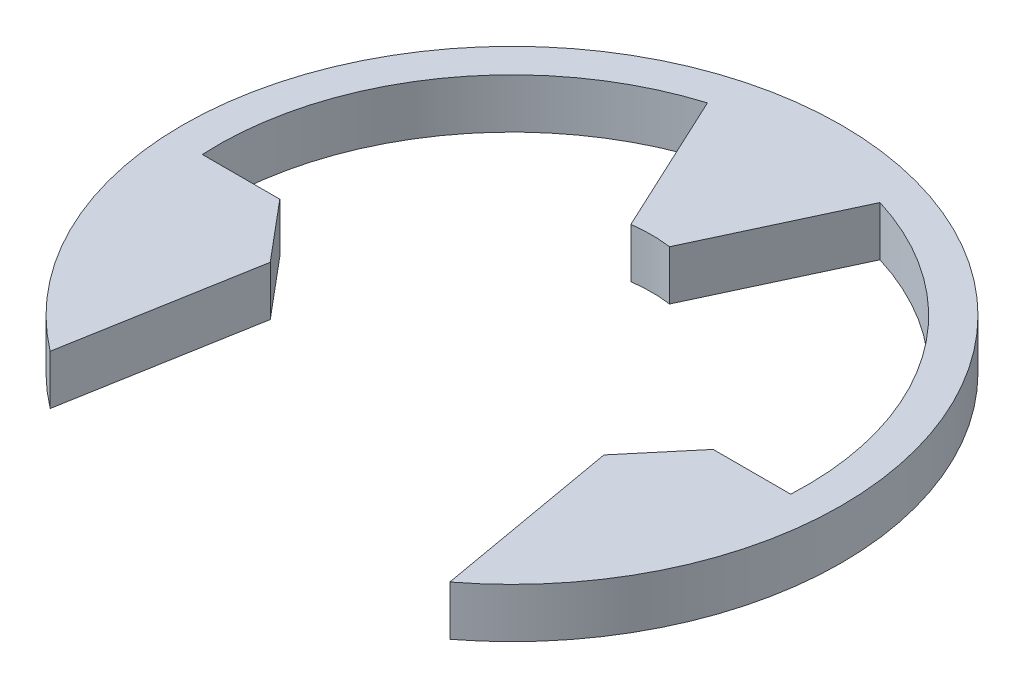
ISO-10303-21;
HEADER;
FILE_DESCRIPTION(('STEP AP214'),'2;1');
FILE_NAME('part.step','',(''),(''),'','','');
FILE_SCHEMA(('AUTOMOTIVE_DESIGN { 1 0 10303 214 1 1 1 1 }'));
ENDSEC;
DATA;
#1=APPLICATION_CONTEXT('core data for automotive mechanical design processes');
#2=APPLICATION_PROTOCOL_DEFINITION('international standard','automotive_design',2000,#1);
#3=PRODUCT_CONTEXT('',#1,'mechanical');
#4=PRODUCT('Part','Part','',(#3));
#5=PRODUCT_RELATED_PRODUCT_CATEGORY('part','',(#4));
#6=PRODUCT_DEFINITION_FORMATION('','',#4);
#7=PRODUCT_DEFINITION_CONTEXT('part definition',#1,'design');
#8=PRODUCT_DEFINITION('design','',#6,#7);
#9=PRODUCT_DEFINITION_SHAPE('','',#8);
#10=(LENGTH_UNIT() NAMED_UNIT(*) SI_UNIT(.MILLI.,.METRE.));
#11=(NAMED_UNIT(*) PLANE_ANGLE_UNIT() SI_UNIT($,.RADIAN.));
#12=(NAMED_UNIT(*) SI_UNIT($,.STERADIAN.) SOLID_ANGLE_UNIT());
#13=UNCERTAINTY_MEASURE_WITH_UNIT(LENGTH_MEASURE(1.E-05),#10,'distance_accuracy_value','');
#14=(GEOMETRIC_REPRESENTATION_CONTEXT(3) GLOBAL_UNCERTAINTY_ASSIGNED_CONTEXT((#13)) GLOBAL_UNIT_ASSIGNED_CONTEXT((#10,
#11,#12)) REPRESENTATION_CONTEXT('',''));
#15=CARTESIAN_POINT('',(0.,0.,0.));
#16=DIRECTION('',(0.,0.,1.));
#17=DIRECTION('',(1.,0.,0.));
#18=AXIS2_PLACEMENT_3D('',#15,#16,#17);
#19=CARTESIAN_POINT('',(0.,0.64,0.));
#20=DIRECTION('',(0.,-1.,0.));
#21=DIRECTION('',(0.,0.,-1.));
#22=AXIS2_PLACEMENT_3D('',#19,#20,#21);
#23=CYLINDRICAL_SURFACE('',#22,1.8);
#24=CARTESIAN_POINT('',(0.,0.,0.));
#25=DIRECTION('',(0.,1.,0.));
#26=DIRECTION('',(0.,0.,1.));
#27=AXIS2_PLACEMENT_3D('',#24,#25,#26);
#28=CIRCLE('',#27,1.8);
#29=CARTESIAN_POINT('',(0.24951124097924,0.,-1.78262282623807));
#30=VERTEX_POINT('',#29);
#31=CARTESIAN_POINT('',(-0.249511240979239,0.,-1.78262282623807));
#32=VERTEX_POINT('',#31);
#33=EDGE_CURVE('E150',#30,#32,#28,.T.);
#34=ORIENTED_EDGE('',*,*,#33,.F.);
#35=DIRECTION('',(0.,-1.,0.));
#36=VECTOR('',#35,1.);
#37=CARTESIAN_POINT('',(0.24951124097924,0.64,-1.78262282623807));
#38=LINE('',#37,#36);
#39=CARTESIAN_POINT('',(0.24951124097924,0.64,-1.78262282623807));
#40=VERTEX_POINT('',#39);
#41=EDGE_CURVE('E11',#40,#30,#38,.T.);
#42=ORIENTED_EDGE('',*,*,#41,.F.);
#43=CARTESIAN_POINT('',(0.,0.64,0.));
#44=DIRECTION('',(0.,1.,0.));
#45=DIRECTION('',(0.,0.,1.));
#46=AXIS2_PLACEMENT_3D('',#43,#44,#45);
#47=CIRCLE('',#46,1.8);
#48=CARTESIAN_POINT('',(-0.249511240979239,0.64,-1.78262282623807));
#49=VERTEX_POINT('',#48);
#50=EDGE_CURVE('E182',#40,#49,#47,.T.);
#51=ORIENTED_EDGE('',*,*,#50,.T.);
#52=DIRECTION('',(0.,-1.,0.));
#53=VECTOR('',#52,1.);
#54=CARTESIAN_POINT('',(-0.249511240979239,0.64,-1.78262282623807));
#55=LINE('',#54,#53);
#56=EDGE_CURVE('E48',#49,#32,#55,.T.);
#57=ORIENTED_EDGE('',*,*,#56,.T.);
#58=EDGE_LOOP('',(#34,#42,#51,#57));
#59=FACE_BOUND('',#58,.T.);
#60=ADVANCED_FACE('F32',(#59),#23,.F.);
#61=CARTESIAN_POINT('',(-0.477837167529248,0.64,-0.222819130569977));
#62=DIRECTION('',(-0.906307787036653,0.,-0.422618261740693));
#63=DIRECTION('',(-0.422618261740694,0.,0.906307787036653));
#64=AXIS2_PLACEMENT_3D('',#61,#62,#63);
#65=PLANE('',#64);
#66=DIRECTION('',(0.422618261740693,0.,-0.906307787036653));
#67=VECTOR('',#66,1.);
#68=CARTESIAN_POINT('',(-0.477837167529248,0.,-0.222819130569977));
#69=LINE('',#68,#67);
#70=CARTESIAN_POINT('',(1.11257947383086,0.,-3.63347862446035));
#71=VERTEX_POINT('',#70);
#72=EDGE_CURVE('E152',#30,#71,#69,.T.);
#73=ORIENTED_EDGE('',*,*,#72,.T.);
#74=DIRECTION('',(0.,-1.,0.));
#75=VECTOR('',#74,1.);
#76=CARTESIAN_POINT('',(1.11257947383086,0.64,-3.63347862446035));
#77=LINE('',#76,#75);
#78=CARTESIAN_POINT('',(1.11257947383086,0.64,-3.63347862446035));
#79=VERTEX_POINT('',#78);
#80=EDGE_CURVE('E40',#79,#71,#77,.T.);
#81=ORIENTED_EDGE('',*,*,#80,.F.);
#82=DIRECTION('',(0.422618261740693,0.,-0.906307787036653));
#83=VECTOR('',#82,1.);
#84=CARTESIAN_POINT('',(-0.477837167529248,0.64,-0.222819130569977));
#85=LINE('',#84,#83);
#86=EDGE_CURVE('E218',#40,#79,#85,.T.);
#87=ORIENTED_EDGE('',*,*,#86,.F.);
#88=ORIENTED_EDGE('',*,*,#41,.T.);
#89=EDGE_LOOP('',(#73,#81,#87,#88));
#90=FACE_BOUND('',#89,.T.);
#91=ADVANCED_FACE('F206',(#90),#65,.F.);
#92=CARTESIAN_POINT('',(0.,0.64,0.));
#93=DIRECTION('',(0.,-1.,0.));
#94=DIRECTION('',(0.,0.,-1.));
#95=AXIS2_PLACEMENT_3D('',#92,#93,#94);
#96=CYLINDRICAL_SURFACE('',#95,3.8);
#97=CARTESIAN_POINT('',(0.,0.,0.));
#98=DIRECTION('',(0.,1.,0.));
#99=DIRECTION('',(0.,0.,1.));
#100=AXIS2_PLACEMENT_3D('',#97,#98,#99);
#101=CIRCLE('',#100,3.8);
#102=CARTESIAN_POINT('',(3.79473319220206,0.,0.199999999999999));
#103=VERTEX_POINT('',#102);
#104=EDGE_CURVE('E155',#103,#71,#101,.T.);
#105=ORIENTED_EDGE('',*,*,#104,.F.);
#106=DIRECTION('',(0.,-1.,0.));
#107=VECTOR('',#106,1.);
#108=CARTESIAN_POINT('',(3.79473319220206,0.64,0.199999999999999));
#109=LINE('',#108,#107);
#110=CARTESIAN_POINT('',(3.79473319220206,0.64,0.199999999999999));
#111=VERTEX_POINT('',#110);
#112=EDGE_CURVE('E196',#111,#103,#109,.T.);
#113=ORIENTED_EDGE('',*,*,#112,.F.);
#114=CARTESIAN_POINT('',(0.,0.64,0.));
#115=DIRECTION('',(0.,1.,0.));
#116=DIRECTION('',(0.,0.,1.));
#117=AXIS2_PLACEMENT_3D('',#114,#115,#116);
#118=CIRCLE('',#117,3.8);
#119=EDGE_CURVE('E203',#111,#79,#118,.T.);
#120=ORIENTED_EDGE('',*,*,#119,.T.);
#121=ORIENTED_EDGE('',*,*,#80,.T.);
#122=EDGE_LOOP('',(#105,#113,#120,#121));
#123=FACE_BOUND('',#122,.T.);
#124=ADVANCED_FACE('F201',(#123),#96,.F.);
#125=CARTESIAN_POINT('',(0.,0.64,0.2));
#126=DIRECTION('',(0.,0.,-1.));
#127=DIRECTION('',(-1.,0.,0.));
#128=AXIS2_PLACEMENT_3D('',#125,#126,#127);
#129=PLANE('',#128);
#130=DIRECTION('',(1.,0.,0.));
#131=VECTOR('',#130,1.);
#132=CARTESIAN_POINT('',(0.,0.,0.2));
#133=LINE('',#132,#131);
#134=CARTESIAN_POINT('',(2.79473319220206,0.,0.199999999999999));
#135=VERTEX_POINT('',#134);
#136=EDGE_CURVE('E158',#135,#103,#133,.T.);
#137=ORIENTED_EDGE('',*,*,#136,.F.);
#138=DIRECTION('',(0.,-1.,0.));
#139=VECTOR('',#138,1.);
#140=CARTESIAN_POINT('',(2.79473319220206,0.64,0.199999999999999));
#141=LINE('',#140,#139);
#142=CARTESIAN_POINT('',(2.79473319220206,0.64,0.199999999999999));
#143=VERTEX_POINT('',#142);
#144=EDGE_CURVE('E194',#143,#135,#141,.T.);
#145=ORIENTED_EDGE('',*,*,#144,.F.);
#146=DIRECTION('',(1.,0.,0.));
#147=VECTOR('',#146,1.);
#148=CARTESIAN_POINT('',(0.,0.64,0.2));
#149=LINE('',#148,#147);
#150=EDGE_CURVE('E215',#143,#111,#149,.T.);
#151=ORIENTED_EDGE('',*,*,#150,.T.);
#152=ORIENTED_EDGE('',*,*,#112,.T.);
#153=EDGE_LOOP('',(#137,#145,#151,#152));
#154=FACE_BOUND('',#153,.T.);
#155=ADVANCED_FACE('F212',(#154),#129,.T.);
#156=CARTESIAN_POINT('',(1.73849753434784,0.64,1.45877263987388));
#157=DIRECTION('',(-0.76604444311898,0.,-0.642787609686537));
#158=DIRECTION('',(-0.642787609686537,0.,0.76604444311898));
#159=AXIS2_PLACEMENT_3D('',#156,#157,#158);
#160=PLANE('',#159);
#161=DIRECTION('',(0.642787609686537,0.,-0.76604444311898));
#162=VECTOR('',#161,1.);
#163=CARTESIAN_POINT('',(1.73849753434784,0.,1.45877263987388));
#164=LINE('',#163,#162);
#165=CARTESIAN_POINT('',(2.15194558251552,0.,0.966044443118979));
#166=VERTEX_POINT('',#165);
#167=EDGE_CURVE('E161',#166,#135,#164,.T.);
#168=ORIENTED_EDGE('',*,*,#167,.F.);
#169=DIRECTION('',(0.,-1.,0.));
#170=VECTOR('',#169,1.);
#171=CARTESIAN_POINT('',(2.15194558251552,0.64,0.966044443118979));
#172=LINE('',#171,#170);
#173=CARTESIAN_POINT('',(2.15194558251552,0.64,0.966044443118979));
#174=VERTEX_POINT('',#173);
#175=EDGE_CURVE('E192',#174,#166,#172,.T.);
#176=ORIENTED_EDGE('',*,*,#175,.F.);
#177=DIRECTION('',(0.642787609686537,0.,-0.76604444311898));
#178=VECTOR('',#177,1.);
#179=CARTESIAN_POINT('',(1.73849753434784,0.64,1.45877263987388));
#180=LINE('',#179,#178);
#181=EDGE_CURVE('E220',#174,#143,#180,.T.);
#182=ORIENTED_EDGE('',*,*,#181,.T.);
#183=ORIENTED_EDGE('',*,*,#144,.T.);
#184=EDGE_LOOP('',(#168,#176,#182,#183));
#185=FACE_BOUND('',#184,.T.);
#186=ADVANCED_FACE('F258',(#185),#160,.T.);
#187=CARTESIAN_POINT('',(1.92185315392182,0.64,-0.338874563996086));
#188=DIRECTION('',(-0.984807753012207,0.,0.173648177666935));
#189=DIRECTION('',(0.173648177666935,0.,0.984807753012207));
#190=AXIS2_PLACEMENT_3D('',#187,#188,#189);
#191=PLANE('',#190);
#192=DIRECTION('',(-0.173648177666935,0.,-0.984807753012207));
#193=VECTOR('',#192,1.);
#194=CARTESIAN_POINT('',(1.92185315392182,0.,-0.338874563996086));
#195=LINE('',#194,#193);
#196=CARTESIAN_POINT('',(2.57745596691439,0.,3.37923375021874));
#197=VERTEX_POINT('',#196);
#198=EDGE_CURVE('E164',#197,#166,#195,.T.);
#199=ORIENTED_EDGE('',*,*,#198,.F.);
#200=DIRECTION('',(0.,-1.,0.));
#201=VECTOR('',#200,1.);
#202=CARTESIAN_POINT('',(2.57745596691439,0.64,3.37923375021874));
#203=LINE('',#202,#201);
#204=CARTESIAN_POINT('',(2.57745596691439,0.64,3.37923375021874));
#205=VERTEX_POINT('',#204);
#206=EDGE_CURVE('E190',#205,#197,#203,.T.);
#207=ORIENTED_EDGE('',*,*,#206,.F.);
#208=DIRECTION('',(-0.173648177666935,0.,-0.984807753012207));
#209=VECTOR('',#208,1.);
#210=CARTESIAN_POINT('',(1.92185315392182,0.64,-0.338874563996086));
#211=LINE('',#210,#209);
#212=EDGE_CURVE('E226',#205,#174,#211,.T.);
#213=ORIENTED_EDGE('',*,*,#212,.T.);
#214=ORIENTED_EDGE('',*,*,#175,.T.);
#215=EDGE_LOOP('',(#199,#207,#213,#214));
#216=FACE_BOUND('',#215,.T.);
#217=ADVANCED_FACE('F261',(#216),#191,.T.);
#218=CARTESIAN_POINT('',(0.,0.64,0.));
#219=DIRECTION('',(0.,-1.,0.));
#220=DIRECTION('',(0.,0.,-1.));
#221=AXIS2_PLACEMENT_3D('',#218,#219,#220);
#222=CYLINDRICAL_SURFACE('',#221,4.25);
#223=CARTESIAN_POINT('',(0.,0.,0.));
#224=DIRECTION('',(0.,1.,0.));
#225=DIRECTION('',(0.,0.,1.));
#226=AXIS2_PLACEMENT_3D('',#223,#224,#225);
#227=CIRCLE('',#226,4.25);
#228=CARTESIAN_POINT('',(-2.57745596691438,0.,3.37923375021875));
#229=VERTEX_POINT('',#228);
#230=EDGE_CURVE('E167',#197,#229,#227,.T.);
#231=ORIENTED_EDGE('',*,*,#230,.T.);
#232=DIRECTION('',(0.,-1.,0.));
#233=VECTOR('',#232,1.);
#234=CARTESIAN_POINT('',(-2.57745596691438,0.64,3.37923375021875));
#235=LINE('',#234,#233);
#236=CARTESIAN_POINT('',(-2.57745596691438,0.64,3.37923375021875));
#237=VERTEX_POINT('',#236);
#238=EDGE_CURVE('E188',#237,#229,#235,.T.);
#239=ORIENTED_EDGE('',*,*,#238,.F.);
#240=CARTESIAN_POINT('',(0.,0.64,0.));
#241=DIRECTION('',(0.,1.,0.));
#242=DIRECTION('',(0.,0.,1.));
#243=AXIS2_PLACEMENT_3D('',#240,#241,#242);
#244=CIRCLE('',#243,4.25);
#245=EDGE_CURVE('E229',#205,#237,#244,.T.);
#246=ORIENTED_EDGE('',*,*,#245,.F.);
#247=ORIENTED_EDGE('',*,*,#206,.T.);
#248=EDGE_LOOP('',(#231,#239,#246,#247));
#249=FACE_BOUND('',#248,.T.);
#250=ADVANCED_FACE('F265',(#249),#222,.T.);
#251=CARTESIAN_POINT('',(-1.92185315392168,0.64,-0.338874563996129));
#252=DIRECTION('',(0.984807753012201,0.,0.173648177666969));
#253=DIRECTION('',(0.173648177666969,0.,-0.984807753012201));
#254=AXIS2_PLACEMENT_3D('',#251,#252,#253);
#255=PLANE('',#254);
#256=DIRECTION('',(-0.173648177666969,0.,0.984807753012201));
#257=VECTOR('',#256,1.);
#258=CARTESIAN_POINT('',(-1.92185315392168,0.,-0.338874563996129));
#259=LINE('',#258,#257);
#260=CARTESIAN_POINT('',(-2.15194558251552,0.,0.96604444311898));
#261=VERTEX_POINT('',#260);
#262=EDGE_CURVE('E170',#261,#229,#259,.T.);
#263=ORIENTED_EDGE('',*,*,#262,.F.);
#264=DIRECTION('',(0.,-1.,0.));
#265=VECTOR('',#264,1.);
#266=CARTESIAN_POINT('',(-2.15194558251552,0.64,0.96604444311898));
#267=LINE('',#266,#265);
#268=CARTESIAN_POINT('',(-2.15194558251552,0.64,0.96604444311898));
#269=VERTEX_POINT('',#268);
#270=EDGE_CURVE('E186',#269,#261,#267,.T.);
#271=ORIENTED_EDGE('',*,*,#270,.F.);
#272=DIRECTION('',(-0.173648177666969,0.,0.984807753012201));
#273=VECTOR('',#272,1.);
#274=CARTESIAN_POINT('',(-1.92185315392168,0.64,-0.338874563996129));
#275=LINE('',#274,#273);
#276=EDGE_CURVE('E231',#269,#237,#275,.T.);
#277=ORIENTED_EDGE('',*,*,#276,.T.);
#278=ORIENTED_EDGE('',*,*,#238,.T.);
#279=EDGE_LOOP('',(#263,#271,#277,#278));
#280=FACE_BOUND('',#279,.T.);
#281=ADVANCED_FACE('F269',(#280),#255,.T.);
#282=CARTESIAN_POINT('',(-1.73849753434784,0.64,1.45877263987388));
#283=DIRECTION('',(0.766044443118979,0.,-0.642787609686537));
#284=DIRECTION('',(-0.642787609686538,0.,-0.76604444311898));
#285=AXIS2_PLACEMENT_3D('',#282,#283,#284);
#286=PLANE('',#285);
#287=DIRECTION('',(0.642787609686538,0.,0.76604444311898));
#288=VECTOR('',#287,1.);
#289=CARTESIAN_POINT('',(-1.73849753434784,0.,1.45877263987388));
#290=LINE('',#289,#288);
#291=CARTESIAN_POINT('',(-2.79473319220206,0.,0.2));
#292=VERTEX_POINT('',#291);
#293=EDGE_CURVE('E173',#292,#261,#290,.T.);
#294=ORIENTED_EDGE('',*,*,#293,.F.);
#295=DIRECTION('',(0.,-1.,0.));
#296=VECTOR('',#295,1.);
#297=CARTESIAN_POINT('',(-2.79473319220206,0.64,0.2));
#298=LINE('',#297,#296);
#299=CARTESIAN_POINT('',(-2.79473319220206,0.64,0.2));
#300=VERTEX_POINT('',#299);
#301=EDGE_CURVE('E131',#300,#292,#298,.T.);
#302=ORIENTED_EDGE('',*,*,#301,.F.);
#303=DIRECTION('',(0.642787609686538,0.,0.76604444311898));
#304=VECTOR('',#303,1.);
#305=CARTESIAN_POINT('',(-1.73849753434784,0.64,1.45877263987388));
#306=LINE('',#305,#304);
#307=EDGE_CURVE('E142',#300,#269,#306,.T.);
#308=ORIENTED_EDGE('',*,*,#307,.T.);
#309=ORIENTED_EDGE('',*,*,#270,.T.);
#310=EDGE_LOOP('',(#294,#302,#308,#309));
#311=FACE_BOUND('',#310,.T.);
#312=ADVANCED_FACE('F235',(#311),#286,.T.);
#313=CARTESIAN_POINT('',(0.,0.64,0.2));
#314=DIRECTION('',(0.,0.,-1.));
#315=DIRECTION('',(-1.,0.,0.));
#316=AXIS2_PLACEMENT_3D('',#313,#314,#315);
#317=PLANE('',#316);
#318=DIRECTION('',(1.,0.,0.));
#319=VECTOR('',#318,1.);
#320=CARTESIAN_POINT('',(0.,0.,0.2));
#321=LINE('',#320,#319);
#322=CARTESIAN_POINT('',(-3.79473319220206,0.,0.2));
#323=VERTEX_POINT('',#322);
#324=EDGE_CURVE('E127',#323,#292,#321,.T.);
#325=ORIENTED_EDGE('',*,*,#324,.F.);
#326=DIRECTION('',(0.,-1.,0.));
#327=VECTOR('',#326,1.);
#328=CARTESIAN_POINT('',(-3.79473319220206,0.64,0.2));
#329=LINE('',#328,#327);
#330=CARTESIAN_POINT('',(-3.79473319220206,0.64,0.2));
#331=VERTEX_POINT('',#330);
#332=EDGE_CURVE('E122',#331,#323,#329,.T.);
#333=ORIENTED_EDGE('',*,*,#332,.F.);
#334=DIRECTION('',(1.,0.,0.));
#335=VECTOR('',#334,1.);
#336=CARTESIAN_POINT('',(0.,0.64,0.2));
#337=LINE('',#336,#335);
#338=EDGE_CURVE('E125',#331,#300,#337,.T.);
#339=ORIENTED_EDGE('',*,*,#338,.T.);
#340=ORIENTED_EDGE('',*,*,#301,.T.);
#341=EDGE_LOOP('',(#325,#333,#339,#340));
#342=FACE_BOUND('',#341,.T.);
#343=ADVANCED_FACE('F124',(#342),#317,.T.);
#344=CARTESIAN_POINT('',(0.,0.64,0.));
#345=DIRECTION('',(0.,-1.,0.));
#346=DIRECTION('',(0.,0.,-1.));
#347=AXIS2_PLACEMENT_3D('',#344,#345,#346);
#348=CYLINDRICAL_SURFACE('',#347,3.8);
#349=CARTESIAN_POINT('',(0.,0.,0.));
#350=DIRECTION('',(0.,1.,0.));
#351=DIRECTION('',(0.,0.,1.));
#352=AXIS2_PLACEMENT_3D('',#349,#350,#351);
#353=CIRCLE('',#352,3.8);
#354=CARTESIAN_POINT('',(-1.11257947383086,0.,-3.63347862446035));
#355=VERTEX_POINT('',#354);
#356=EDGE_CURVE('E177',#355,#323,#353,.T.);
#357=ORIENTED_EDGE('',*,*,#356,.F.);
#358=DIRECTION('',(0.,-1.,0.));
#359=VECTOR('',#358,1.);
#360=CARTESIAN_POINT('',(-1.11257947383086,0.64,-3.63347862446035));
#361=LINE('',#360,#359);
#362=CARTESIAN_POINT('',(-1.11257947383086,0.64,-3.63347862446035));
#363=VERTEX_POINT('',#362);
#364=EDGE_CURVE('E85',#363,#355,#361,.T.);
#365=ORIENTED_EDGE('',*,*,#364,.F.);
#366=CARTESIAN_POINT('',(0.,0.64,0.));
#367=DIRECTION('',(0.,1.,0.));
#368=DIRECTION('',(0.,0.,1.));
#369=AXIS2_PLACEMENT_3D('',#366,#367,#368);
#370=CIRCLE('',#369,3.8);
#371=EDGE_CURVE('E139',#363,#331,#370,.T.);
#372=ORIENTED_EDGE('',*,*,#371,.T.);
#373=ORIENTED_EDGE('',*,*,#332,.T.);
#374=EDGE_LOOP('',(#357,#365,#372,#373));
#375=FACE_BOUND('',#374,.T.);
#376=ADVANCED_FACE('F144',(#375),#348,.F.);
#377=CARTESIAN_POINT('',(0.477837167529248,0.64,-0.222819130569978));
#378=DIRECTION('',(-0.906307787036653,0.,0.422618261740694));
#379=DIRECTION('',(0.422618261740694,0.,0.906307787036653));
#380=AXIS2_PLACEMENT_3D('',#377,#378,#379);
#381=PLANE('',#380);
#382=DIRECTION('',(-0.422618261740694,0.,-0.906307787036653));
#383=VECTOR('',#382,1.);
#384=CARTESIAN_POINT('',(0.477837167529248,0.,-0.222819130569978));
#385=LINE('',#384,#383);
#386=EDGE_CURVE('E179',#32,#355,#385,.T.);
#387=ORIENTED_EDGE('',*,*,#386,.F.);
#388=ORIENTED_EDGE('',*,*,#56,.F.);
#389=DIRECTION('',(-0.422618261740694,0.,-0.906307787036653));
#390=VECTOR('',#389,1.);
#391=CARTESIAN_POINT('',(0.477837167529248,0.64,-0.222819130569978));
#392=LINE('',#391,#390);
#393=EDGE_CURVE('E145',#49,#363,#392,.T.);
#394=ORIENTED_EDGE('',*,*,#393,.T.);
#395=ORIENTED_EDGE('',*,*,#364,.T.);
#396=EDGE_LOOP('',(#387,#388,#394,#395));
#397=FACE_BOUND('',#396,.T.);
#398=ADVANCED_FACE('F237',(#397),#381,.T.);
#399=CARTESIAN_POINT('',(0.,0.64,0.));
#400=DIRECTION('',(0.,1.,0.));
#401=DIRECTION('',(0.,0.,1.));
#402=AXIS2_PLACEMENT_3D('',#399,#400,#401);
#403=PLANE('',#402);
#404=ORIENTED_EDGE('',*,*,#50,.F.);
#405=ORIENTED_EDGE('',*,*,#86,.T.);
#406=ORIENTED_EDGE('',*,*,#119,.F.);
#407=ORIENTED_EDGE('',*,*,#150,.F.);
#408=ORIENTED_EDGE('',*,*,#181,.F.);
#409=ORIENTED_EDGE('',*,*,#212,.F.);
#410=ORIENTED_EDGE('',*,*,#245,.T.);
#411=ORIENTED_EDGE('',*,*,#276,.F.);
#412=ORIENTED_EDGE('',*,*,#307,.F.);
#413=ORIENTED_EDGE('',*,*,#338,.F.);
#414=ORIENTED_EDGE('',*,*,#371,.F.);
#415=ORIENTED_EDGE('',*,*,#393,.F.);
#416=EDGE_LOOP('',(#404,#405,#406,#407,#408,#409,#410,#411,#412,#413,#414,#415));
#417=FACE_BOUND('',#416,.T.);
#418=ADVANCED_FACE('F137',(#417),#403,.T.);
#419=CARTESIAN_POINT('',(0.,0.,0.));
#420=DIRECTION('',(0.,1.,0.));
#421=DIRECTION('',(0.,0.,1.));
#422=AXIS2_PLACEMENT_3D('',#419,#420,#421);
#423=PLANE('',#422);
#424=ORIENTED_EDGE('',*,*,#33,.T.);
#425=ORIENTED_EDGE('',*,*,#386,.T.);
#426=ORIENTED_EDGE('',*,*,#356,.T.);
#427=ORIENTED_EDGE('',*,*,#324,.T.);
#428=ORIENTED_EDGE('',*,*,#293,.T.);
#429=ORIENTED_EDGE('',*,*,#262,.T.);
#430=ORIENTED_EDGE('',*,*,#230,.F.);
#431=ORIENTED_EDGE('',*,*,#198,.T.);
#432=ORIENTED_EDGE('',*,*,#167,.T.);
#433=ORIENTED_EDGE('',*,*,#136,.T.);
#434=ORIENTED_EDGE('',*,*,#104,.T.);
#435=ORIENTED_EDGE('',*,*,#72,.F.);
#436=EDGE_LOOP('',(#424,#425,#426,#427,#428,#429,#430,#431,#432,#433,#434,#435));
#437=FACE_BOUND('',#436,.T.);
#438=ADVANCED_FACE('F208',(#437),#423,.F.);
#439=CLOSED_SHELL('',(#60,#91,#124,#155,#186,#217,#250,#281,#312,#343,#376,#398,#418,#438));
#440=MANIFOLD_SOLID_BREP('B2',#439);
#441=ADVANCED_BREP_SHAPE_REPRESENTATION('',(#18,#440),#14);
#442=SHAPE_DEFINITION_REPRESENTATION(#9,#441);
ENDSEC;
END-ISO-10303-21;
